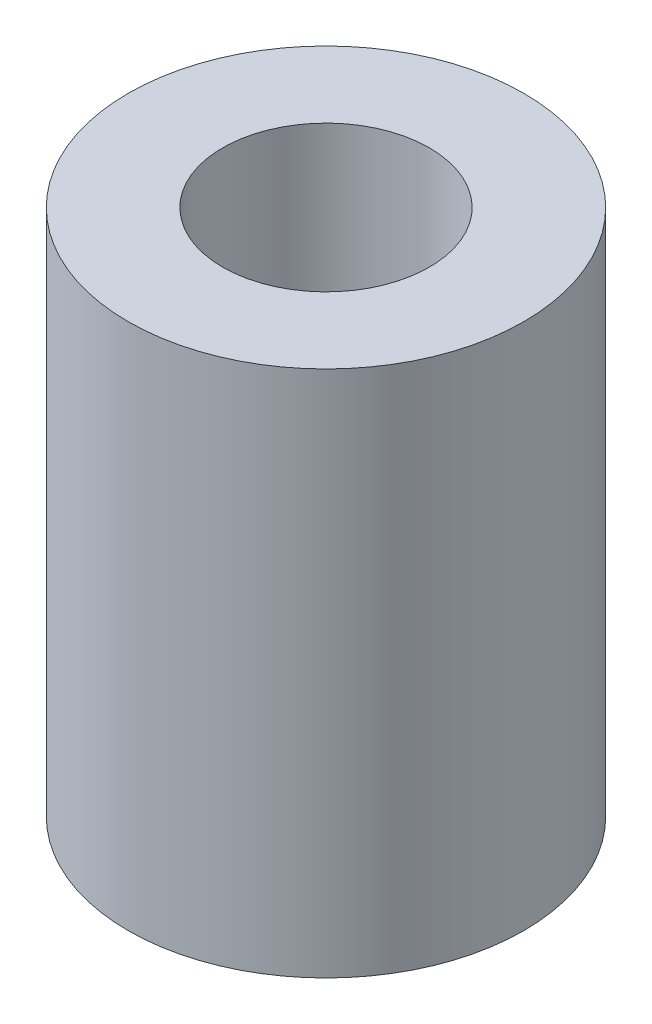
ISO-10303-21;
HEADER;
FILE_DESCRIPTION(('STEP AP214'),'2;1');
FILE_NAME('part.step','',(''),(''),'','','');
FILE_SCHEMA(('AUTOMOTIVE_DESIGN { 1 0 10303 214 1 1 1 1 }'));
ENDSEC;
DATA;
#1=APPLICATION_CONTEXT('core data for automotive mechanical design processes');
#2=APPLICATION_PROTOCOL_DEFINITION('international standard','automotive_design',2000,#1);
#3=PRODUCT_CONTEXT('',#1,'mechanical');
#4=PRODUCT('Part','Part','',(#3));
#5=PRODUCT_RELATED_PRODUCT_CATEGORY('part','',(#4));
#6=PRODUCT_DEFINITION_FORMATION('','',#4);
#7=PRODUCT_DEFINITION_CONTEXT('part definition',#1,'design');
#8=PRODUCT_DEFINITION('design','',#6,#7);
#9=PRODUCT_DEFINITION_SHAPE('','',#8);
#10=(LENGTH_UNIT() NAMED_UNIT(*) SI_UNIT(.MILLI.,.METRE.));
#11=(NAMED_UNIT(*) PLANE_ANGLE_UNIT() SI_UNIT($,.RADIAN.));
#12=(NAMED_UNIT(*) SI_UNIT($,.STERADIAN.) SOLID_ANGLE_UNIT());
#13=UNCERTAINTY_MEASURE_WITH_UNIT(LENGTH_MEASURE(1.E-05),#10,'distance_accuracy_value','');
#14=(GEOMETRIC_REPRESENTATION_CONTEXT(3) GLOBAL_UNCERTAINTY_ASSIGNED_CONTEXT((#13)) GLOBAL_UNIT_ASSIGNED_CONTEXT((#10,
#11,#12)) REPRESENTATION_CONTEXT('',''));
#15=CARTESIAN_POINT('',(0.,0.,0.));
#16=DIRECTION('',(0.,0.,1.));
#17=DIRECTION('',(1.,0.,0.));
#18=AXIS2_PLACEMENT_3D('',#15,#16,#17);
#19=CARTESIAN_POINT('',(0.,-6.35,0.));
#20=DIRECTION('',(0.,1.,0.));
#21=DIRECTION('',(0.,0.,1.));
#22=AXIS2_PLACEMENT_3D('',#19,#20,#21);
#23=CYLINDRICAL_SURFACE('',#22,4.7625);
#24=CARTESIAN_POINT('',(0.,-6.35,0.));
#25=DIRECTION('',(0.,1.,0.));
#26=DIRECTION('',(0.,0.,-1.));
#27=AXIS2_PLACEMENT_3D('',#24,#25,#26);
#28=CIRCLE('',#27,4.7625);
#29=CARTESIAN_POINT('',(0.,-6.35,-4.7625));
#30=VERTEX_POINT('',#29);
#31=EDGE_CURVE('E10',#30,#30,#28,.T.);
#32=ORIENTED_EDGE('',*,*,#31,.T.);
#33=EDGE_LOOP('',(#32));
#34=FACE_BOUND('',#33,.T.);
#35=CARTESIAN_POINT('',(0.,6.35,0.));
#36=DIRECTION('',(0.,1.,0.));
#37=DIRECTION('',(0.,0.,-1.));
#38=AXIS2_PLACEMENT_3D('',#35,#36,#37);
#39=CIRCLE('',#38,4.7625);
#40=CARTESIAN_POINT('',(0.,6.35,-4.7625));
#41=VERTEX_POINT('',#40);
#42=EDGE_CURVE('E47',#41,#41,#39,.T.);
#43=ORIENTED_EDGE('',*,*,#42,.F.);
#44=EDGE_LOOP('',(#43));
#45=FACE_BOUND('',#44,.T.);
#46=ADVANCED_FACE('F44',(#34,#45),#23,.T.);
#47=CARTESIAN_POINT('',(0.,-6.35,0.));
#48=DIRECTION('',(0.,-1.,0.));
#49=DIRECTION('',(0.,0.,-1.));
#50=AXIS2_PLACEMENT_3D('',#47,#48,#49);
#51=PLANE('',#50);
#52=CARTESIAN_POINT('',(0.,-6.35,0.));
#53=DIRECTION('',(0.,1.,0.));
#54=DIRECTION('',(0.,0.,-1.));
#55=AXIS2_PLACEMENT_3D('',#52,#53,#54);
#56=CIRCLE('',#55,2.4892);
#57=CARTESIAN_POINT('',(0.,-6.35,-2.4892));
#58=VERTEX_POINT('',#57);
#59=EDGE_CURVE('E56',#58,#58,#56,.T.);
#60=ORIENTED_EDGE('',*,*,#59,.T.);
#61=EDGE_LOOP('',(#60));
#62=FACE_BOUND('',#61,.T.);
#63=ORIENTED_EDGE('',*,*,#31,.F.);
#64=EDGE_LOOP('',(#63));
#65=FACE_BOUND('',#64,.T.);
#66=ADVANCED_FACE('F66',(#62,#65),#51,.T.);
#67=CARTESIAN_POINT('',(0.,6.35,0.));
#68=DIRECTION('',(0.,-1.,0.));
#69=DIRECTION('',(0.,0.,-1.));
#70=AXIS2_PLACEMENT_3D('',#67,#68,#69);
#71=PLANE('',#70);
#72=CARTESIAN_POINT('',(0.,6.35,0.));
#73=DIRECTION('',(0.,1.,0.));
#74=DIRECTION('',(0.,0.,-1.));
#75=AXIS2_PLACEMENT_3D('',#72,#73,#74);
#76=CIRCLE('',#75,2.4892);
#77=CARTESIAN_POINT('',(0.,6.35,-2.4892));
#78=VERTEX_POINT('',#77);
#79=EDGE_CURVE('E58',#78,#78,#76,.T.);
#80=ORIENTED_EDGE('',*,*,#79,.F.);
#81=EDGE_LOOP('',(#80));
#82=FACE_BOUND('',#81,.T.);
#83=ORIENTED_EDGE('',*,*,#42,.T.);
#84=EDGE_LOOP('',(#83));
#85=FACE_BOUND('',#84,.T.);
#86=ADVANCED_FACE('F72',(#82,#85),#71,.F.);
#87=CARTESIAN_POINT('',(0.,-6.35,0.));
#88=DIRECTION('',(0.,1.,0.));
#89=DIRECTION('',(0.,0.,1.));
#90=AXIS2_PLACEMENT_3D('',#87,#88,#89);
#91=CYLINDRICAL_SURFACE('',#90,2.4892);
#92=ORIENTED_EDGE('',*,*,#59,.F.);
#93=EDGE_LOOP('',(#92));
#94=FACE_BOUND('',#93,.T.);
#95=ORIENTED_EDGE('',*,*,#79,.T.);
#96=EDGE_LOOP('',(#95));
#97=FACE_BOUND('',#96,.T.);
#98=ADVANCED_FACE('F69',(#94,#97),#91,.F.);
#99=CLOSED_SHELL('',(#46,#66,#86,#98));
#100=MANIFOLD_SOLID_BREP('B2',#99);
#101=ADVANCED_BREP_SHAPE_REPRESENTATION('',(#18,#100),#14);
#102=SHAPE_DEFINITION_REPRESENTATION(#9,#101);
ENDSEC;
END-ISO-10303-21;
